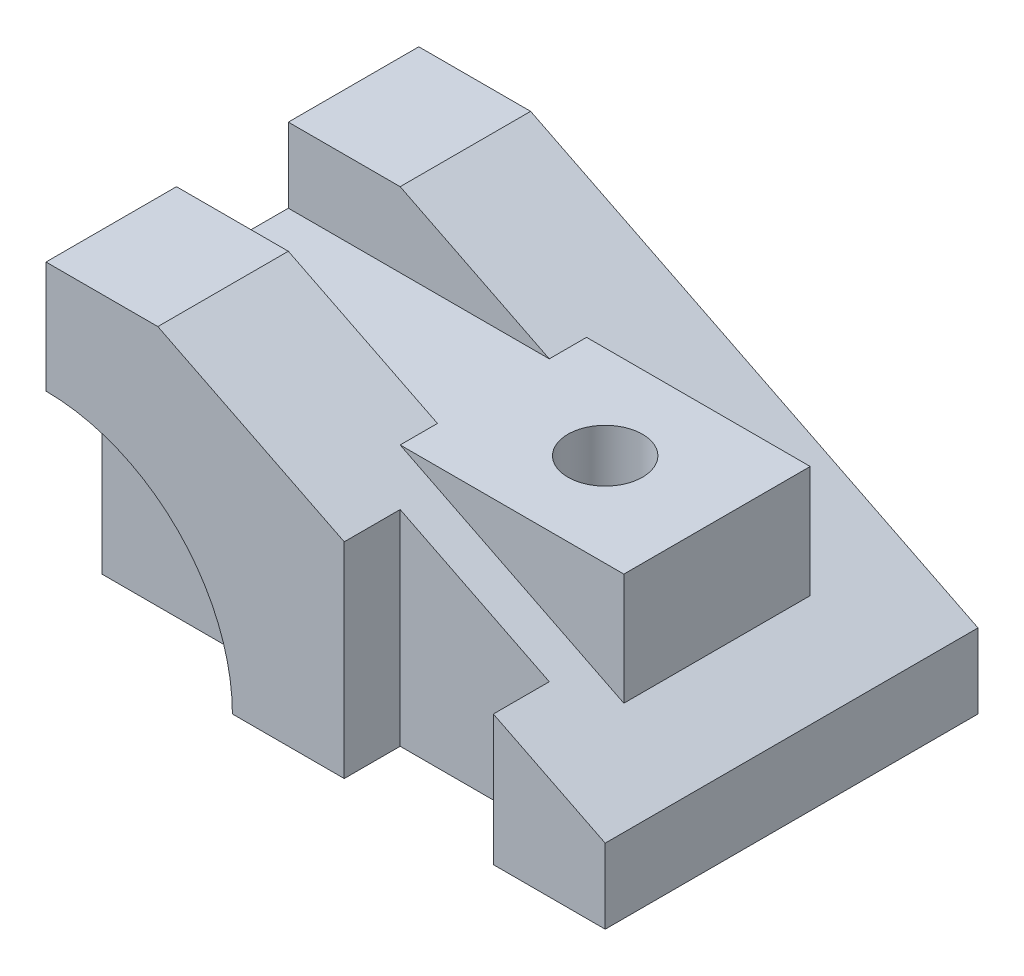
ISO-10303-21;
HEADER;
FILE_DESCRIPTION(('STEP AP214'),'2;1');
FILE_NAME('part.step','',(''),(''),'','','');
FILE_SCHEMA(('AUTOMOTIVE_DESIGN { 1 0 10303 214 1 1 1 1 }'));
ENDSEC;
DATA;
#1=APPLICATION_CONTEXT('core data for automotive mechanical design processes');
#2=APPLICATION_PROTOCOL_DEFINITION('international standard','automotive_design',2000,#1);
#3=PRODUCT_CONTEXT('',#1,'mechanical');
#4=PRODUCT('Part','Part','',(#3));
#5=PRODUCT_RELATED_PRODUCT_CATEGORY('part','',(#4));
#6=PRODUCT_DEFINITION_FORMATION('','',#4);
#7=PRODUCT_DEFINITION_CONTEXT('part definition',#1,'design');
#8=PRODUCT_DEFINITION('design','',#6,#7);
#9=PRODUCT_DEFINITION_SHAPE('','',#8);
#10=(LENGTH_UNIT() NAMED_UNIT(*) SI_UNIT(.MILLI.,.METRE.));
#11=(NAMED_UNIT(*) PLANE_ANGLE_UNIT() SI_UNIT($,.RADIAN.));
#12=(NAMED_UNIT(*) SI_UNIT($,.STERADIAN.) SOLID_ANGLE_UNIT());
#13=UNCERTAINTY_MEASURE_WITH_UNIT(LENGTH_MEASURE(1.E-05),#10,'distance_accuracy_value','');
#14=(GEOMETRIC_REPRESENTATION_CONTEXT(3) GLOBAL_UNCERTAINTY_ASSIGNED_CONTEXT((#13)) GLOBAL_UNIT_ASSIGNED_CONTEXT((#10,
#11,#12)) REPRESENTATION_CONTEXT('',''));
#15=CARTESIAN_POINT('',(0.,0.,0.));
#16=DIRECTION('',(0.,0.,1.));
#17=DIRECTION('',(1.,0.,0.));
#18=AXIS2_PLACEMENT_3D('',#15,#16,#17);
#19=CARTESIAN_POINT('',(0.,0.,50.));
#20=DIRECTION('',(0.,0.,-1.));
#21=DIRECTION('',(-1.,0.,0.));
#22=AXIS2_PLACEMENT_3D('',#19,#20,#21);
#23=PLANE('',#22);
#24=DIRECTION('',(-1.,0.,0.));
#25=VECTOR('',#24,1.);
#26=CARTESIAN_POINT('',(150.,0.,50.));
#27=LINE('',#26,#25);
#28=CARTESIAN_POINT('',(80.,0.,50.));
#29=VERTEX_POINT('',#28);
#30=CARTESIAN_POINT('',(50.,0.,50.));
#31=VERTEX_POINT('',#30);
#32=EDGE_CURVE('E315',#29,#31,#27,.T.);
#33=ORIENTED_EDGE('',*,*,#32,.F.);
#34=DIRECTION('',(0.,1.,0.));
#35=VECTOR('',#34,1.);
#36=CARTESIAN_POINT('',(80.,0.,50.));
#37=LINE('',#36,#35);
#38=CARTESIAN_POINT('',(80.,55.,50.));
#39=VERTEX_POINT('',#38);
#40=EDGE_CURVE('E11',#29,#39,#37,.T.);
#41=ORIENTED_EDGE('',*,*,#40,.T.);
#42=DIRECTION('',(0.894427190999916,-0.447213595499958,0.));
#43=VECTOR('',#42,1.);
#44=CARTESIAN_POINT('',(30.,80.,50.));
#45=LINE('',#44,#43);
#46=CARTESIAN_POINT('',(30.,80.,50.));
#47=VERTEX_POINT('',#46);
#48=EDGE_CURVE('E327',#47,#39,#45,.T.);
#49=ORIENTED_EDGE('',*,*,#48,.F.);
#50=DIRECTION('',(1.,0.,0.));
#51=VECTOR('',#50,1.);
#52=CARTESIAN_POINT('',(0.,80.,50.));
#53=LINE('',#52,#51);
#54=CARTESIAN_POINT('',(0.,80.,50.));
#55=VERTEX_POINT('',#54);
#56=EDGE_CURVE('E322',#55,#47,#53,.T.);
#57=ORIENTED_EDGE('',*,*,#56,.F.);
#58=DIRECTION('',(0.,1.,0.));
#59=VECTOR('',#58,1.);
#60=CARTESIAN_POINT('',(0.,0.,50.));
#61=LINE('',#60,#59);
#62=CARTESIAN_POINT('',(0.,50.,50.));
#63=VERTEX_POINT('',#62);
#64=EDGE_CURVE('E319',#63,#55,#61,.T.);
#65=ORIENTED_EDGE('',*,*,#64,.F.);
#66=CARTESIAN_POINT('',(0.,0.,50.));
#67=DIRECTION('',(0.,0.,1.));
#68=DIRECTION('',(1.,0.,0.));
#69=AXIS2_PLACEMENT_3D('',#66,#67,#68);
#70=CIRCLE('',#69,50.);
#71=EDGE_CURVE('E266',#31,#63,#70,.T.);
#72=ORIENTED_EDGE('',*,*,#71,.F.);
#73=EDGE_LOOP('',(#33,#41,#49,#57,#65,#72));
#74=FACE_BOUND('',#73,.T.);
#75=ADVANCED_FACE('F43',(#74),#23,.F.);
#76=CARTESIAN_POINT('',(30.,80.,50.));
#77=DIRECTION('',(0.447213595499958,0.894427190999916,0.));
#78=DIRECTION('',(-0.894427190999916,0.447213595499958,0.));
#79=AXIS2_PLACEMENT_3D('',#76,#77,#78);
#80=PLANE('',#79);
#81=DIRECTION('',(0.,0.,1.));
#82=VECTOR('',#81,1.);
#83=CARTESIAN_POINT('',(80.,55.,50.));
#84=LINE('',#83,#82);
#85=CARTESIAN_POINT('',(80.,55.,35.));
#86=VERTEX_POINT('',#85);
#87=EDGE_CURVE('E203',#86,#39,#84,.T.);
#88=ORIENTED_EDGE('',*,*,#87,.F.);
#89=DIRECTION('',(-0.894427190999916,0.447213595499958,0.));
#90=VECTOR('',#89,1.);
#91=CARTESIAN_POINT('',(30.,80.,35.));
#92=LINE('',#91,#90);
#93=CARTESIAN_POINT('',(120.,35.,35.));
#94=VERTEX_POINT('',#93);
#95=EDGE_CURVE('E176',#94,#86,#92,.T.);
#96=ORIENTED_EDGE('',*,*,#95,.F.);
#97=DIRECTION('',(0.,0.,-1.));
#98=VECTOR('',#97,1.);
#99=CARTESIAN_POINT('',(120.,35.,50.));
#100=LINE('',#99,#98);
#101=CARTESIAN_POINT('',(120.,35.,50.));
#102=VERTEX_POINT('',#101);
#103=EDGE_CURVE('E199',#102,#94,#100,.T.);
#104=ORIENTED_EDGE('',*,*,#103,.F.);
#105=CARTESIAN_POINT('',(150.,20.,50.));
#106=VERTEX_POINT('',#105);
#107=EDGE_CURVE('E326',#102,#106,#45,.T.);
#108=ORIENTED_EDGE('',*,*,#107,.T.);
#109=DIRECTION('',(0.,0.,-1.));
#110=VECTOR('',#109,1.);
#111=CARTESIAN_POINT('',(150.,20.,50.));
#112=LINE('',#111,#110);
#113=CARTESIAN_POINT('',(150.,20.,-50.));
#114=VERTEX_POINT('',#113);
#115=EDGE_CURVE('E332',#106,#114,#112,.T.);
#116=ORIENTED_EDGE('',*,*,#115,.T.);
#117=DIRECTION('',(0.894427190999916,-0.447213595499958,0.));
#118=VECTOR('',#117,1.);
#119=CARTESIAN_POINT('',(30.,80.,-50.));
#120=LINE('',#119,#118);
#121=CARTESIAN_POINT('',(30.,80.,-50.));
#122=VERTEX_POINT('',#121);
#123=EDGE_CURVE('E307',#122,#114,#120,.T.);
#124=ORIENTED_EDGE('',*,*,#123,.F.);
#125=DIRECTION('',(0.,0.,-1.));
#126=VECTOR('',#125,1.);
#127=CARTESIAN_POINT('',(30.,80.,50.));
#128=LINE('',#127,#126);
#129=CARTESIAN_POINT('',(30.,80.,-15.));
#130=VERTEX_POINT('',#129);
#131=EDGE_CURVE('E340',#130,#122,#128,.T.);
#132=ORIENTED_EDGE('',*,*,#131,.F.);
#133=DIRECTION('',(0.894427190999916,-0.447213595499958,0.));
#134=VECTOR('',#133,1.);
#135=CARTESIAN_POINT('',(30.,80.,-15.));
#136=LINE('',#135,#134);
#137=CARTESIAN_POINT('',(70.,60.,-15.));
#138=VERTEX_POINT('',#137);
#139=EDGE_CURVE('E222',#130,#138,#136,.T.);
#140=ORIENTED_EDGE('',*,*,#139,.T.);
#141=DIRECTION('',(0.,0.,1.));
#142=VECTOR('',#141,1.);
#143=CARTESIAN_POINT('',(70.,60.,-25.));
#144=LINE('',#143,#142);
#145=CARTESIAN_POINT('',(70.,60.,-25.));
#146=VERTEX_POINT('',#145);
#147=EDGE_CURVE('E263',#146,#138,#144,.T.);
#148=ORIENTED_EDGE('',*,*,#147,.F.);
#149=DIRECTION('',(0.894427190999916,-0.447213595499958,0.));
#150=VECTOR('',#149,1.);
#151=CARTESIAN_POINT('',(130.,30.,-25.));
#152=LINE('',#151,#150);
#153=CARTESIAN_POINT('',(130.,30.,-25.));
#154=VERTEX_POINT('',#153);
#155=EDGE_CURVE('E250',#146,#154,#152,.T.);
#156=ORIENTED_EDGE('',*,*,#155,.T.);
#157=DIRECTION('',(0.,0.,1.));
#158=VECTOR('',#157,1.);
#159=CARTESIAN_POINT('',(130.,30.,-25.));
#160=LINE('',#159,#158);
#161=CARTESIAN_POINT('',(130.,30.,25.));
#162=VERTEX_POINT('',#161);
#163=EDGE_CURVE('E262',#154,#162,#160,.T.);
#164=ORIENTED_EDGE('',*,*,#163,.T.);
#165=DIRECTION('',(0.894427190999916,-0.447213595499958,0.));
#166=VECTOR('',#165,1.);
#167=CARTESIAN_POINT('',(130.,30.,25.));
#168=LINE('',#167,#166);
#169=CARTESIAN_POINT('',(70.,60.,25.));
#170=VERTEX_POINT('',#169);
#171=EDGE_CURVE('E238',#170,#162,#168,.T.);
#172=ORIENTED_EDGE('',*,*,#171,.F.);
#173=CARTESIAN_POINT('',(70.,60.,15.));
#174=VERTEX_POINT('',#173);
#175=EDGE_CURVE('E267',#174,#170,#144,.T.);
#176=ORIENTED_EDGE('',*,*,#175,.F.);
#177=DIRECTION('',(-0.894427190999916,0.447213595499958,0.));
#178=VECTOR('',#177,1.);
#179=CARTESIAN_POINT('',(30.,80.,15.));
#180=LINE('',#179,#178);
#181=CARTESIAN_POINT('',(30.,80.,15.));
#182=VERTEX_POINT('',#181);
#183=EDGE_CURVE('E234',#174,#182,#180,.T.);
#184=ORIENTED_EDGE('',*,*,#183,.T.);
#185=EDGE_CURVE('E336',#47,#182,#128,.T.);
#186=ORIENTED_EDGE('',*,*,#185,.F.);
#187=ORIENTED_EDGE('',*,*,#48,.T.);
#188=EDGE_LOOP('',(#88,#96,#104,#108,#116,#124,#132,#140,#148,#156,#164,#172,#176,#184,#186,#187));
#189=FACE_BOUND('',#188,.T.);
#190=ADVANCED_FACE('F370',(#189),#80,.T.);
#191=CARTESIAN_POINT('',(0.,80.,50.));
#192=DIRECTION('',(0.,1.,0.));
#193=DIRECTION('',(0.,0.,1.));
#194=AXIS2_PLACEMENT_3D('',#191,#192,#193);
#195=PLANE('',#194);
#196=ORIENTED_EDGE('',*,*,#185,.T.);
#197=DIRECTION('',(-1.,0.,0.));
#198=VECTOR('',#197,1.);
#199=CARTESIAN_POINT('',(0.,80.,15.));
#200=LINE('',#199,#198);
#201=CARTESIAN_POINT('',(0.,80.,15.));
#202=VERTEX_POINT('',#201);
#203=EDGE_CURVE('E230',#182,#202,#200,.T.);
#204=ORIENTED_EDGE('',*,*,#203,.T.);
#205=DIRECTION('',(0.,0.,-1.));
#206=VECTOR('',#205,1.);
#207=CARTESIAN_POINT('',(0.,80.,50.));
#208=LINE('',#207,#206);
#209=EDGE_CURVE('E341',#55,#202,#208,.T.);
#210=ORIENTED_EDGE('',*,*,#209,.F.);
#211=ORIENTED_EDGE('',*,*,#56,.T.);
#212=EDGE_LOOP('',(#196,#204,#210,#211));
#213=FACE_BOUND('',#212,.T.);
#214=ADVANCED_FACE('F404',(#213),#195,.T.);
#215=CARTESIAN_POINT('',(0.,80.,-15.));
#216=VERTEX_POINT('',#215);
#217=CARTESIAN_POINT('',(0.,80.,-50.));
#218=VERTEX_POINT('',#217);
#219=EDGE_CURVE('E345',#216,#218,#208,.T.);
#220=ORIENTED_EDGE('',*,*,#219,.F.);
#221=DIRECTION('',(1.,0.,0.));
#222=VECTOR('',#221,1.);
#223=CARTESIAN_POINT('',(0.,80.,-15.));
#224=LINE('',#223,#222);
#225=EDGE_CURVE('E218',#216,#130,#224,.T.);
#226=ORIENTED_EDGE('',*,*,#225,.T.);
#227=ORIENTED_EDGE('',*,*,#131,.T.);
#228=DIRECTION('',(1.,0.,0.));
#229=VECTOR('',#228,1.);
#230=CARTESIAN_POINT('',(0.,80.,-50.));
#231=LINE('',#230,#229);
#232=EDGE_CURVE('E303',#218,#122,#231,.T.);
#233=ORIENTED_EDGE('',*,*,#232,.F.);
#234=EDGE_LOOP('',(#220,#226,#227,#233));
#235=FACE_BOUND('',#234,.T.);
#236=ADVANCED_FACE('F378',(#235),#195,.T.);
#237=CARTESIAN_POINT('',(0.,0.,50.));
#238=DIRECTION('',(-1.,0.,0.));
#239=DIRECTION('',(0.,0.,1.));
#240=AXIS2_PLACEMENT_3D('',#237,#238,#239);
#241=PLANE('',#240);
#242=ORIENTED_EDGE('',*,*,#209,.T.);
#243=DIRECTION('',(0.,-1.,0.));
#244=VECTOR('',#243,1.);
#245=CARTESIAN_POINT('',(0.,0.,15.));
#246=LINE('',#245,#244);
#247=CARTESIAN_POINT('',(0.,60.,15.));
#248=VERTEX_POINT('',#247);
#249=EDGE_CURVE('E226',#202,#248,#246,.T.);
#250=ORIENTED_EDGE('',*,*,#249,.T.);
#251=DIRECTION('',(0.,0.,-1.));
#252=VECTOR('',#251,1.);
#253=CARTESIAN_POINT('',(0.,60.,50.));
#254=LINE('',#253,#252);
#255=CARTESIAN_POINT('',(0.,60.,-15.));
#256=VERTEX_POINT('',#255);
#257=EDGE_CURVE('E354',#248,#256,#254,.T.);
#258=ORIENTED_EDGE('',*,*,#257,.T.);
#259=DIRECTION('',(0.,1.,0.));
#260=VECTOR('',#259,1.);
#261=CARTESIAN_POINT('',(0.,0.,-15.));
#262=LINE('',#261,#260);
#263=EDGE_CURVE('E214',#256,#216,#262,.T.);
#264=ORIENTED_EDGE('',*,*,#263,.T.);
#265=ORIENTED_EDGE('',*,*,#219,.T.);
#266=DIRECTION('',(0.,1.,0.));
#267=VECTOR('',#266,1.);
#268=CARTESIAN_POINT('',(0.,0.,-50.));
#269=LINE('',#268,#267);
#270=CARTESIAN_POINT('',(0.,0.,-50.));
#271=VERTEX_POINT('',#270);
#272=EDGE_CURVE('E299',#271,#218,#269,.T.);
#273=ORIENTED_EDGE('',*,*,#272,.F.);
#274=DIRECTION('',(0.,0.,-1.));
#275=VECTOR('',#274,1.);
#276=CARTESIAN_POINT('',(0.,0.,50.));
#277=LINE('',#276,#275);
#278=CARTESIAN_POINT('',(0.,0.,35.));
#279=VERTEX_POINT('',#278);
#280=EDGE_CURVE('E346',#279,#271,#277,.T.);
#281=ORIENTED_EDGE('',*,*,#280,.F.);
#282=DIRECTION('',(0.,1.,0.));
#283=VECTOR('',#282,1.);
#284=CARTESIAN_POINT('',(0.,0.,35.));
#285=LINE('',#284,#283);
#286=CARTESIAN_POINT('',(0.,50.,35.));
#287=VERTEX_POINT('',#286);
#288=EDGE_CURVE('E287',#279,#287,#285,.T.);
#289=ORIENTED_EDGE('',*,*,#288,.T.);
#290=DIRECTION('',(0.,0.,1.));
#291=VECTOR('',#290,1.);
#292=CARTESIAN_POINT('',(0.,50.,35.));
#293=LINE('',#292,#291);
#294=EDGE_CURVE('E284',#63,#287,#293,.F.);
#295=ORIENTED_EDGE('',*,*,#294,.F.);
#296=ORIENTED_EDGE('',*,*,#64,.T.);
#297=EDGE_LOOP('',(#242,#250,#258,#264,#265,#273,#281,#289,#295,#296));
#298=FACE_BOUND('',#297,.T.);
#299=ADVANCED_FACE('F400',(#298),#241,.T.);
#300=CARTESIAN_POINT('',(150.,20.,50.));
#301=DIRECTION('',(1.,0.,0.));
#302=DIRECTION('',(0.,0.,-1.));
#303=AXIS2_PLACEMENT_3D('',#300,#301,#302);
#304=PLANE('',#303);
#305=DIRECTION('',(0.,0.,-1.));
#306=VECTOR('',#305,1.);
#307=CARTESIAN_POINT('',(150.,0.,50.));
#308=LINE('',#307,#306);
#309=CARTESIAN_POINT('',(150.,0.,50.));
#310=VERTEX_POINT('',#309);
#311=CARTESIAN_POINT('',(150.,0.,-50.));
#312=VERTEX_POINT('',#311);
#313=EDGE_CURVE('E331',#310,#312,#308,.T.);
#314=ORIENTED_EDGE('',*,*,#313,.T.);
#315=DIRECTION('',(0.,-1.,0.));
#316=VECTOR('',#315,1.);
#317=CARTESIAN_POINT('',(150.,20.,-50.));
#318=LINE('',#317,#316);
#319=EDGE_CURVE('E291',#114,#312,#318,.T.);
#320=ORIENTED_EDGE('',*,*,#319,.F.);
#321=ORIENTED_EDGE('',*,*,#115,.F.);
#322=DIRECTION('',(0.,-1.,0.));
#323=VECTOR('',#322,1.);
#324=CARTESIAN_POINT('',(150.,20.,50.));
#325=LINE('',#324,#323);
#326=EDGE_CURVE('E311',#106,#310,#325,.T.);
#327=ORIENTED_EDGE('',*,*,#326,.T.);
#328=EDGE_LOOP('',(#314,#320,#321,#327));
#329=FACE_BOUND('',#328,.T.);
#330=ADVANCED_FACE('F45',(#329),#304,.T.);
#331=CARTESIAN_POINT('',(150.,0.,50.));
#332=DIRECTION('',(0.,-1.,0.));
#333=DIRECTION('',(1.,0.,0.));
#334=AXIS2_PLACEMENT_3D('',#331,#332,#333);
#335=PLANE('',#334);
#336=CARTESIAN_POINT('',(100.,0.,0.));
#337=DIRECTION('',(0.,1.,0.));
#338=DIRECTION('',(0.,0.,1.));
#339=AXIS2_PLACEMENT_3D('',#336,#337,#338);
#340=CIRCLE('',#339,9.99999999999999);
#341=CARTESIAN_POINT('',(100.,0.,9.99999999999999));
#342=VERTEX_POINT('',#341);
#343=EDGE_CURVE('E188',#342,#342,#340,.T.);
#344=ORIENTED_EDGE('',*,*,#343,.T.);
#345=EDGE_LOOP('',(#344));
#346=FACE_BOUND('',#345,.T.);
#347=DIRECTION('',(0.,0.,-1.));
#348=VECTOR('',#347,1.);
#349=CARTESIAN_POINT('',(80.,0.,50.));
#350=LINE('',#349,#348);
#351=CARTESIAN_POINT('',(80.,0.,35.));
#352=VERTEX_POINT('',#351);
#353=EDGE_CURVE('E183',#29,#352,#350,.T.);
#354=ORIENTED_EDGE('',*,*,#353,.F.);
#355=ORIENTED_EDGE('',*,*,#32,.T.);
#356=DIRECTION('',(0.,0.,1.));
#357=VECTOR('',#356,1.);
#358=CARTESIAN_POINT('',(50.,0.,35.));
#359=LINE('',#358,#357);
#360=CARTESIAN_POINT('',(50.,0.,35.));
#361=VERTEX_POINT('',#360);
#362=EDGE_CURVE('E278',#361,#31,#359,.T.);
#363=ORIENTED_EDGE('',*,*,#362,.F.);
#364=DIRECTION('',(-1.,0.,0.));
#365=VECTOR('',#364,1.);
#366=CARTESIAN_POINT('',(150.,0.,35.));
#367=LINE('',#366,#365);
#368=EDGE_CURVE('E335',#361,#279,#367,.T.);
#369=ORIENTED_EDGE('',*,*,#368,.T.);
#370=ORIENTED_EDGE('',*,*,#280,.T.);
#371=DIRECTION('',(-1.,0.,0.));
#372=VECTOR('',#371,1.);
#373=CARTESIAN_POINT('',(150.,0.,-50.));
#374=LINE('',#373,#372);
#375=EDGE_CURVE('E295',#312,#271,#374,.T.);
#376=ORIENTED_EDGE('',*,*,#375,.F.);
#377=ORIENTED_EDGE('',*,*,#313,.F.);
#378=CARTESIAN_POINT('',(120.,0.,50.));
#379=VERTEX_POINT('',#378);
#380=EDGE_CURVE('E316',#310,#379,#27,.T.);
#381=ORIENTED_EDGE('',*,*,#380,.T.);
#382=DIRECTION('',(0.,0.,1.));
#383=VECTOR('',#382,1.);
#384=CARTESIAN_POINT('',(120.,0.,50.));
#385=LINE('',#384,#383);
#386=CARTESIAN_POINT('',(120.,0.,35.));
#387=VERTEX_POINT('',#386);
#388=EDGE_CURVE('E59',#387,#379,#385,.T.);
#389=ORIENTED_EDGE('',*,*,#388,.F.);
#390=DIRECTION('',(1.,0.,0.));
#391=VECTOR('',#390,1.);
#392=CARTESIAN_POINT('',(80.,0.,35.));
#393=LINE('',#392,#391);
#394=EDGE_CURVE('E174',#352,#387,#393,.T.);
#395=ORIENTED_EDGE('',*,*,#394,.F.);
#396=EDGE_LOOP('',(#354,#355,#363,#369,#370,#376,#377,#381,#389,#395));
#397=FACE_BOUND('',#396,.T.);
#398=ADVANCED_FACE('F190',(#346,#397),#335,.T.);
#399=ORIENTED_EDGE('',*,*,#107,.F.);
#400=DIRECTION('',(0.,-1.,0.));
#401=VECTOR('',#400,1.);
#402=CARTESIAN_POINT('',(120.,0.,50.));
#403=LINE('',#402,#401);
#404=EDGE_CURVE('E52',#102,#379,#403,.T.);
#405=ORIENTED_EDGE('',*,*,#404,.T.);
#406=ORIENTED_EDGE('',*,*,#380,.F.);
#407=ORIENTED_EDGE('',*,*,#326,.F.);
#408=EDGE_LOOP('',(#399,#405,#406,#407));
#409=FACE_BOUND('',#408,.T.);
#410=ADVANCED_FACE('F361',(#409),#23,.F.);
#411=CARTESIAN_POINT('',(0.,0.,-50.));
#412=DIRECTION('',(0.,0.,-1.));
#413=DIRECTION('',(-1.,0.,0.));
#414=AXIS2_PLACEMENT_3D('',#411,#412,#413);
#415=PLANE('',#414);
#416=ORIENTED_EDGE('',*,*,#319,.T.);
#417=ORIENTED_EDGE('',*,*,#375,.T.);
#418=ORIENTED_EDGE('',*,*,#272,.T.);
#419=ORIENTED_EDGE('',*,*,#232,.T.);
#420=ORIENTED_EDGE('',*,*,#123,.T.);
#421=EDGE_LOOP('',(#416,#417,#418,#419,#420));
#422=FACE_BOUND('',#421,.T.);
#423=ADVANCED_FACE('F373',(#422),#415,.T.);
#424=CARTESIAN_POINT('',(0.,0.,35.));
#425=DIRECTION('',(0.,0.,1.));
#426=DIRECTION('',(1.,0.,0.));
#427=AXIS2_PLACEMENT_3D('',#424,#425,#426);
#428=CYLINDRICAL_SURFACE('',#427,50.);
#429=ORIENTED_EDGE('',*,*,#294,.T.);
#430=CARTESIAN_POINT('',(0.,0.,35.));
#431=DIRECTION('',(0.,0.,1.));
#432=DIRECTION('',(1.,0.,0.));
#433=AXIS2_PLACEMENT_3D('',#430,#431,#432);
#434=CIRCLE('',#433,50.);
#435=EDGE_CURVE('E274',#361,#287,#434,.T.);
#436=ORIENTED_EDGE('',*,*,#435,.F.);
#437=ORIENTED_EDGE('',*,*,#362,.T.);
#438=ORIENTED_EDGE('',*,*,#71,.T.);
#439=EDGE_LOOP('',(#429,#436,#437,#438));
#440=FACE_BOUND('',#439,.T.);
#441=ADVANCED_FACE('F433',(#440),#428,.F.);
#442=CARTESIAN_POINT('',(0.,0.,35.));
#443=DIRECTION('',(0.,0.,1.));
#444=DIRECTION('',(1.,0.,0.));
#445=AXIS2_PLACEMENT_3D('',#442,#443,#444);
#446=PLANE('',#445);
#447=ORIENTED_EDGE('',*,*,#368,.F.);
#448=ORIENTED_EDGE('',*,*,#435,.T.);
#449=ORIENTED_EDGE('',*,*,#288,.F.);
#450=EDGE_LOOP('',(#447,#448,#449));
#451=FACE_BOUND('',#450,.T.);
#452=ADVANCED_FACE('F476',(#451),#446,.T.);
#453=CARTESIAN_POINT('',(70.,60.,-25.));
#454=DIRECTION('',(0.,1.,0.));
#455=DIRECTION('',(0.,0.,1.));
#456=AXIS2_PLACEMENT_3D('',#453,#454,#455);
#457=PLANE('',#456);
#458=CARTESIAN_POINT('',(100.,60.,0.));
#459=DIRECTION('',(0.,1.,0.));
#460=DIRECTION('',(0.,0.,1.));
#461=AXIS2_PLACEMENT_3D('',#458,#459,#460);
#462=CIRCLE('',#461,9.99999999999999);
#463=CARTESIAN_POINT('',(100.,60.,9.99999999999999));
#464=VERTEX_POINT('',#463);
#465=EDGE_CURVE('E632',#464,#464,#462,.T.);
#466=ORIENTED_EDGE('',*,*,#465,.F.);
#467=EDGE_LOOP('',(#466));
#468=FACE_BOUND('',#467,.T.);
#469=ORIENTED_EDGE('',*,*,#147,.T.);
#470=DIRECTION('',(-1.,0.,0.));
#471=VECTOR('',#470,1.);
#472=CARTESIAN_POINT('',(-23.2102553608765,60.,-15.));
#473=LINE('',#472,#471);
#474=EDGE_CURVE('E67',#138,#256,#473,.T.);
#475=ORIENTED_EDGE('',*,*,#474,.T.);
#476=ORIENTED_EDGE('',*,*,#257,.F.);
#477=DIRECTION('',(1.,0.,0.));
#478=VECTOR('',#477,1.);
#479=CARTESIAN_POINT('',(-23.2102553608765,60.,15.));
#480=LINE('',#479,#478);
#481=EDGE_CURVE('E208',#248,#174,#480,.T.);
#482=ORIENTED_EDGE('',*,*,#481,.T.);
#483=ORIENTED_EDGE('',*,*,#175,.T.);
#484=DIRECTION('',(-1.,0.,0.));
#485=VECTOR('',#484,1.);
#486=CARTESIAN_POINT('',(70.,60.,25.));
#487=LINE('',#486,#485);
#488=CARTESIAN_POINT('',(130.,60.,25.));
#489=VERTEX_POINT('',#488);
#490=EDGE_CURVE('E246',#489,#170,#487,.T.);
#491=ORIENTED_EDGE('',*,*,#490,.F.);
#492=DIRECTION('',(0.,0.,1.));
#493=VECTOR('',#492,1.);
#494=CARTESIAN_POINT('',(130.,60.,-25.));
#495=LINE('',#494,#493);
#496=CARTESIAN_POINT('',(130.,60.,-25.));
#497=VERTEX_POINT('',#496);
#498=EDGE_CURVE('E268',#497,#489,#495,.T.);
#499=ORIENTED_EDGE('',*,*,#498,.F.);
#500=DIRECTION('',(-1.,0.,0.));
#501=VECTOR('',#500,1.);
#502=CARTESIAN_POINT('',(70.,60.,-25.));
#503=LINE('',#502,#501);
#504=EDGE_CURVE('E258',#497,#146,#503,.T.);
#505=ORIENTED_EDGE('',*,*,#504,.T.);
#506=EDGE_LOOP('',(#469,#475,#476,#482,#483,#491,#499,#505));
#507=FACE_BOUND('',#506,.T.);
#508=ADVANCED_FACE('F386',(#468,#507),#457,.T.);
#509=CARTESIAN_POINT('',(130.,60.,-25.));
#510=DIRECTION('',(1.,0.,0.));
#511=DIRECTION('',(0.,1.,0.));
#512=AXIS2_PLACEMENT_3D('',#509,#510,#511);
#513=PLANE('',#512);
#514=ORIENTED_EDGE('',*,*,#498,.T.);
#515=DIRECTION('',(0.,1.,0.));
#516=VECTOR('',#515,1.);
#517=CARTESIAN_POINT('',(130.,60.,25.));
#518=LINE('',#517,#516);
#519=EDGE_CURVE('E242',#162,#489,#518,.T.);
#520=ORIENTED_EDGE('',*,*,#519,.F.);
#521=ORIENTED_EDGE('',*,*,#163,.F.);
#522=DIRECTION('',(0.,1.,0.));
#523=VECTOR('',#522,1.);
#524=CARTESIAN_POINT('',(130.,60.,-25.));
#525=LINE('',#524,#523);
#526=EDGE_CURVE('E254',#154,#497,#525,.T.);
#527=ORIENTED_EDGE('',*,*,#526,.T.);
#528=EDGE_LOOP('',(#514,#520,#521,#527));
#529=FACE_BOUND('',#528,.T.);
#530=ADVANCED_FACE('F394',(#529),#513,.T.);
#531=CARTESIAN_POINT('',(0.,0.,-25.));
#532=DIRECTION('',(0.,0.,1.));
#533=DIRECTION('',(1.,0.,0.));
#534=AXIS2_PLACEMENT_3D('',#531,#532,#533);
#535=PLANE('',#534);
#536=ORIENTED_EDGE('',*,*,#155,.F.);
#537=ORIENTED_EDGE('',*,*,#504,.F.);
#538=ORIENTED_EDGE('',*,*,#526,.F.);
#539=EDGE_LOOP('',(#536,#537,#538));
#540=FACE_BOUND('',#539,.T.);
#541=ADVANCED_FACE('F499',(#540),#535,.F.);
#542=CARTESIAN_POINT('',(0.,0.,25.));
#543=DIRECTION('',(0.,0.,1.));
#544=DIRECTION('',(1.,0.,0.));
#545=AXIS2_PLACEMENT_3D('',#542,#543,#544);
#546=PLANE('',#545);
#547=ORIENTED_EDGE('',*,*,#171,.T.);
#548=ORIENTED_EDGE('',*,*,#519,.T.);
#549=ORIENTED_EDGE('',*,*,#490,.T.);
#550=EDGE_LOOP('',(#547,#548,#549));
#551=FACE_BOUND('',#550,.T.);
#552=ADVANCED_FACE('F390',(#551),#546,.T.);
#553=CARTESIAN_POINT('',(-23.2102553608765,85.,15.));
#554=DIRECTION('',(0.,0.,-1.));
#555=DIRECTION('',(-1.,0.,0.));
#556=AXIS2_PLACEMENT_3D('',#553,#554,#555);
#557=PLANE('',#556);
#558=ORIENTED_EDGE('',*,*,#481,.F.);
#559=ORIENTED_EDGE('',*,*,#249,.F.);
#560=ORIENTED_EDGE('',*,*,#203,.F.);
#561=ORIENTED_EDGE('',*,*,#183,.F.);
#562=EDGE_LOOP('',(#558,#559,#560,#561));
#563=FACE_BOUND('',#562,.T.);
#564=ADVANCED_FACE('F402',(#563),#557,.T.);
#565=CARTESIAN_POINT('',(-23.2102553608765,85.,-15.));
#566=DIRECTION('',(0.,0.,1.));
#567=DIRECTION('',(1.,0.,0.));
#568=AXIS2_PLACEMENT_3D('',#565,#566,#567);
#569=PLANE('',#568);
#570=ORIENTED_EDGE('',*,*,#225,.F.);
#571=ORIENTED_EDGE('',*,*,#263,.F.);
#572=ORIENTED_EDGE('',*,*,#474,.F.);
#573=ORIENTED_EDGE('',*,*,#139,.F.);
#574=EDGE_LOOP('',(#570,#571,#572,#573));
#575=FACE_BOUND('',#574,.T.);
#576=ADVANCED_FACE('F398',(#575),#569,.T.);
#577=CARTESIAN_POINT('',(80.,80.,50.));
#578=DIRECTION('',(-1.,0.,0.));
#579=DIRECTION('',(0.,-1.,0.));
#580=AXIS2_PLACEMENT_3D('',#577,#578,#579);
#581=PLANE('',#580);
#582=ORIENTED_EDGE('',*,*,#87,.T.);
#583=ORIENTED_EDGE('',*,*,#40,.F.);
#584=ORIENTED_EDGE('',*,*,#353,.T.);
#585=DIRECTION('',(0.,-1.,0.));
#586=VECTOR('',#585,1.);
#587=CARTESIAN_POINT('',(80.,80.,35.));
#588=LINE('',#587,#586);
#589=EDGE_CURVE('E169',#86,#352,#588,.T.);
#590=ORIENTED_EDGE('',*,*,#589,.F.);
#591=EDGE_LOOP('',(#582,#583,#584,#590));
#592=FACE_BOUND('',#591,.T.);
#593=ADVANCED_FACE('F184',(#592),#581,.F.);
#594=CARTESIAN_POINT('',(120.,80.,50.));
#595=DIRECTION('',(1.,0.,0.));
#596=DIRECTION('',(0.,1.,0.));
#597=AXIS2_PLACEMENT_3D('',#594,#595,#596);
#598=PLANE('',#597);
#599=ORIENTED_EDGE('',*,*,#103,.T.);
#600=DIRECTION('',(0.,-1.,0.));
#601=VECTOR('',#600,1.);
#602=CARTESIAN_POINT('',(120.,80.,35.));
#603=LINE('',#602,#601);
#604=EDGE_CURVE('E180',#94,#387,#603,.T.);
#605=ORIENTED_EDGE('',*,*,#604,.T.);
#606=ORIENTED_EDGE('',*,*,#388,.T.);
#607=ORIENTED_EDGE('',*,*,#404,.F.);
#608=EDGE_LOOP('',(#599,#605,#606,#607));
#609=FACE_BOUND('',#608,.T.);
#610=ADVANCED_FACE('F410',(#609),#598,.F.);
#611=CARTESIAN_POINT('',(80.,80.,35.));
#612=DIRECTION('',(0.,0.,-1.));
#613=DIRECTION('',(-1.,0.,0.));
#614=AXIS2_PLACEMENT_3D('',#611,#612,#613);
#615=PLANE('',#614);
#616=ORIENTED_EDGE('',*,*,#95,.T.);
#617=ORIENTED_EDGE('',*,*,#589,.T.);
#618=ORIENTED_EDGE('',*,*,#394,.T.);
#619=ORIENTED_EDGE('',*,*,#604,.F.);
#620=EDGE_LOOP('',(#616,#617,#618,#619));
#621=FACE_BOUND('',#620,.T.);
#622=ADVANCED_FACE('F171',(#621),#615,.F.);
#623=CARTESIAN_POINT('',(100.,0.,0.));
#624=DIRECTION('',(0.,1.,0.));
#625=DIRECTION('',(0.,0.,1.));
#626=AXIS2_PLACEMENT_3D('',#623,#624,#625);
#627=CYLINDRICAL_SURFACE('',#626,9.99999999999999);
#628=ORIENTED_EDGE('',*,*,#343,.F.);
#629=EDGE_LOOP('',(#628));
#630=FACE_BOUND('',#629,.T.);
#631=ORIENTED_EDGE('',*,*,#465,.T.);
#632=EDGE_LOOP('',(#631));
#633=FACE_BOUND('',#632,.T.);
#634=ADVANCED_FACE('F417',(#630,#633),#627,.F.);
#635=CLOSED_SHELL('',(#75,#190,#214,#236,#299,#330,#398,#410,#423,#441,#452,#508,#530,#541,#552,
#564,#576,#593,#610,#622,#634));
#636=MANIFOLD_SOLID_BREP('B2',#635);
#637=ADVANCED_BREP_SHAPE_REPRESENTATION('',(#18,#636),#14);
#638=SHAPE_DEFINITION_REPRESENTATION(#9,#637);
ENDSEC;
END-ISO-10303-21;
